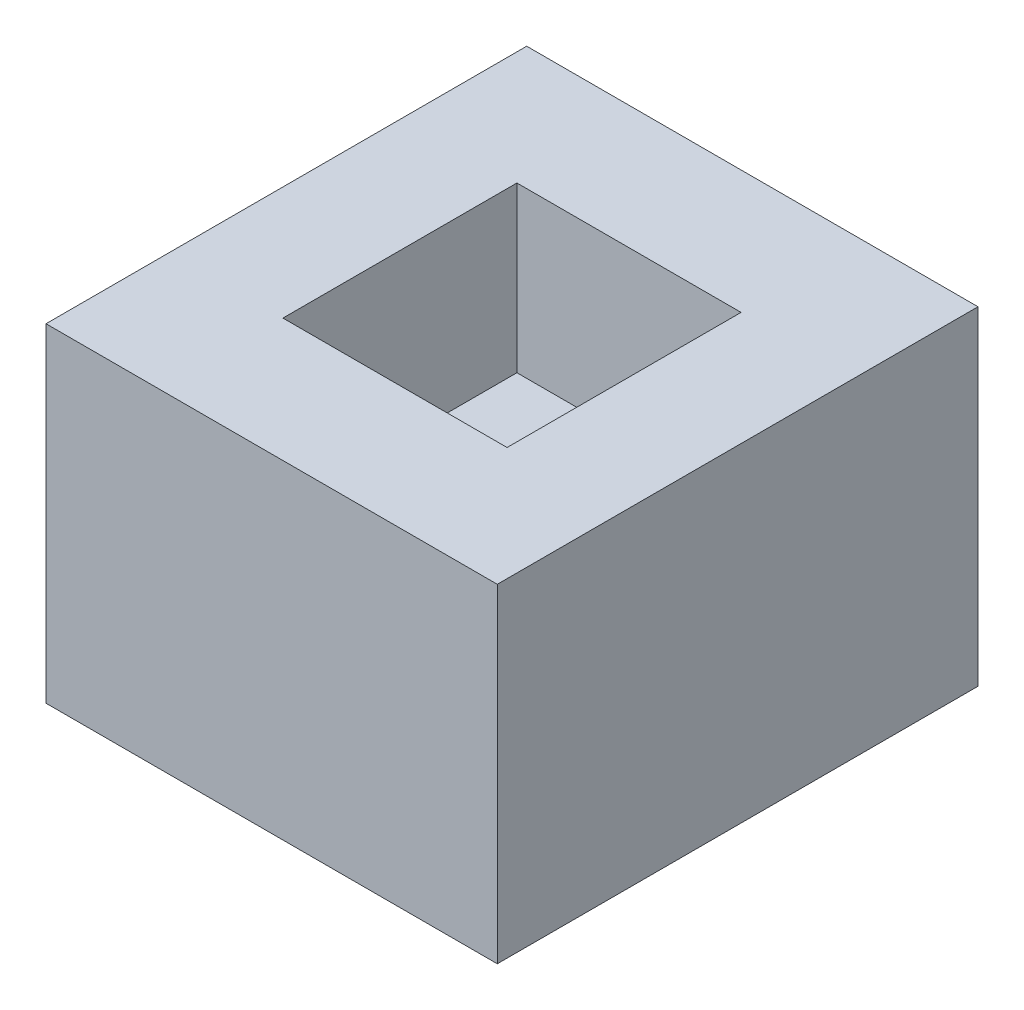
ISO-10303-21;
HEADER;
FILE_DESCRIPTION(('STEP AP214'),'2;1');
FILE_NAME('part.step','',(''),(''),'','','');
FILE_SCHEMA(('AUTOMOTIVE_DESIGN { 1 0 10303 214 1 1 1 1 }'));
ENDSEC;
DATA;
#1=APPLICATION_CONTEXT('core data for automotive mechanical design processes');
#2=APPLICATION_PROTOCOL_DEFINITION('international standard','automotive_design',2000,#1);
#3=PRODUCT_CONTEXT('',#1,'mechanical');
#4=PRODUCT('Part','Part','',(#3));
#5=PRODUCT_RELATED_PRODUCT_CATEGORY('part','',(#4));
#6=PRODUCT_DEFINITION_FORMATION('','',#4);
#7=PRODUCT_DEFINITION_CONTEXT('part definition',#1,'design');
#8=PRODUCT_DEFINITION('design','',#6,#7);
#9=PRODUCT_DEFINITION_SHAPE('','',#8);
#10=(LENGTH_UNIT() NAMED_UNIT(*) SI_UNIT(.MILLI.,.METRE.));
#11=(NAMED_UNIT(*) PLANE_ANGLE_UNIT() SI_UNIT($,.RADIAN.));
#12=(NAMED_UNIT(*) SI_UNIT($,.STERADIAN.) SOLID_ANGLE_UNIT());
#13=UNCERTAINTY_MEASURE_WITH_UNIT(LENGTH_MEASURE(1.E-05),#10,'distance_accuracy_value','');
#14=(GEOMETRIC_REPRESENTATION_CONTEXT(3) GLOBAL_UNCERTAINTY_ASSIGNED_CONTEXT((#13)) GLOBAL_UNIT_ASSIGNED_CONTEXT((#10,
#11,#12)) REPRESENTATION_CONTEXT('',''));
#15=CARTESIAN_POINT('',(0.,0.,0.));
#16=DIRECTION('',(0.,0.,1.));
#17=DIRECTION('',(1.,0.,0.));
#18=AXIS2_PLACEMENT_3D('',#15,#16,#17);
#19=CARTESIAN_POINT('',(-54.9226431235184,80.,58.5022382409761));
#20=DIRECTION('',(1.,0.,0.));
#21=DIRECTION('',(0.,0.,-1.));
#22=AXIS2_PLACEMENT_3D('',#19,#20,#21);
#23=PLANE('',#22);
#24=DIRECTION('',(0.,0.,1.));
#25=VECTOR('',#24,1.);
#26=CARTESIAN_POINT('',(-54.9226431235184,0.,58.5022382409761));
#27=LINE('',#26,#25);
#28=CARTESIAN_POINT('',(-54.9226431235184,0.,-58.5022382409761));
#29=VERTEX_POINT('',#28);
#30=CARTESIAN_POINT('',(-54.9226431235184,0.,58.5022382409761));
#31=VERTEX_POINT('',#30);
#32=EDGE_CURVE('E141',#29,#31,#27,.T.);
#33=ORIENTED_EDGE('',*,*,#32,.T.);
#34=DIRECTION('',(0.,-1.,0.));
#35=VECTOR('',#34,1.);
#36=CARTESIAN_POINT('',(-54.9226431235184,80.,58.5022382409761));
#37=LINE('',#36,#35);
#38=CARTESIAN_POINT('',(-54.9226431235184,80.,58.5022382409761));
#39=VERTEX_POINT('',#38);
#40=EDGE_CURVE('E11',#39,#31,#37,.T.);
#41=ORIENTED_EDGE('',*,*,#40,.F.);
#42=DIRECTION('',(0.,0.,1.));
#43=VECTOR('',#42,1.);
#44=CARTESIAN_POINT('',(-54.9226431235184,80.,58.5022382409761));
#45=LINE('',#44,#43);
#46=CARTESIAN_POINT('',(-54.9226431235184,80.,-58.5022382409761));
#47=VERTEX_POINT('',#46);
#48=EDGE_CURVE('E145',#47,#39,#45,.T.);
#49=ORIENTED_EDGE('',*,*,#48,.F.);
#50=DIRECTION('',(0.,-1.,0.));
#51=VECTOR('',#50,1.);
#52=CARTESIAN_POINT('',(-54.9226431235184,80.,-58.5022382409761));
#53=LINE('',#52,#51);
#54=EDGE_CURVE('E151',#47,#29,#53,.T.);
#55=ORIENTED_EDGE('',*,*,#54,.T.);
#56=EDGE_LOOP('',(#33,#41,#49,#55));
#57=FACE_BOUND('',#56,.T.);
#58=ADVANCED_FACE('F33',(#57),#23,.F.);
#59=CARTESIAN_POINT('',(54.9226431235184,80.,58.5022382409761));
#60=DIRECTION('',(0.,0.,-1.));
#61=DIRECTION('',(-1.,0.,0.));
#62=AXIS2_PLACEMENT_3D('',#59,#60,#61);
#63=PLANE('',#62);
#64=DIRECTION('',(1.,0.,0.));
#65=VECTOR('',#64,1.);
#66=CARTESIAN_POINT('',(54.9226431235184,0.,58.5022382409761));
#67=LINE('',#66,#65);
#68=CARTESIAN_POINT('',(54.9226431235184,0.,58.5022382409761));
#69=VERTEX_POINT('',#68);
#70=EDGE_CURVE('E154',#31,#69,#67,.T.);
#71=ORIENTED_EDGE('',*,*,#70,.T.);
#72=DIRECTION('',(0.,-1.,0.));
#73=VECTOR('',#72,1.);
#74=CARTESIAN_POINT('',(54.9226431235184,80.,58.5022382409761));
#75=LINE('',#74,#73);
#76=CARTESIAN_POINT('',(54.9226431235184,80.,58.5022382409761));
#77=VERTEX_POINT('',#76);
#78=EDGE_CURVE('E40',#77,#69,#75,.T.);
#79=ORIENTED_EDGE('',*,*,#78,.F.);
#80=DIRECTION('',(1.,0.,0.));
#81=VECTOR('',#80,1.);
#82=CARTESIAN_POINT('',(54.9226431235184,80.,58.5022382409761));
#83=LINE('',#82,#81);
#84=EDGE_CURVE('E84',#39,#77,#83,.T.);
#85=ORIENTED_EDGE('',*,*,#84,.F.);
#86=ORIENTED_EDGE('',*,*,#40,.T.);
#87=EDGE_LOOP('',(#71,#79,#85,#86));
#88=FACE_BOUND('',#87,.T.);
#89=ADVANCED_FACE('F183',(#88),#63,.F.);
#90=CARTESIAN_POINT('',(54.9226431235184,80.,58.5022382409761));
#91=DIRECTION('',(-1.,0.,0.));
#92=DIRECTION('',(0.,0.,1.));
#93=AXIS2_PLACEMENT_3D('',#90,#91,#92);
#94=PLANE('',#93);
#95=DIRECTION('',(0.,0.,-1.));
#96=VECTOR('',#95,1.);
#97=CARTESIAN_POINT('',(54.9226431235184,0.,58.5022382409761));
#98=LINE('',#97,#96);
#99=CARTESIAN_POINT('',(54.9226431235184,0.,-58.5022382409761));
#100=VERTEX_POINT('',#99);
#101=EDGE_CURVE('E156',#69,#100,#98,.T.);
#102=ORIENTED_EDGE('',*,*,#101,.T.);
#103=DIRECTION('',(0.,-1.,0.));
#104=VECTOR('',#103,1.);
#105=CARTESIAN_POINT('',(54.9226431235184,80.,-58.5022382409761));
#106=LINE('',#105,#104);
#107=CARTESIAN_POINT('',(54.9226431235184,80.,-58.5022382409761));
#108=VERTEX_POINT('',#107);
#109=EDGE_CURVE('E160',#108,#100,#106,.T.);
#110=ORIENTED_EDGE('',*,*,#109,.F.);
#111=DIRECTION('',(0.,0.,-1.));
#112=VECTOR('',#111,1.);
#113=CARTESIAN_POINT('',(54.9226431235184,80.,58.5022382409761));
#114=LINE('',#113,#112);
#115=EDGE_CURVE('E148',#77,#108,#114,.T.);
#116=ORIENTED_EDGE('',*,*,#115,.F.);
#117=ORIENTED_EDGE('',*,*,#78,.T.);
#118=EDGE_LOOP('',(#102,#110,#116,#117));
#119=FACE_BOUND('',#118,.T.);
#120=ADVANCED_FACE('F165',(#119),#94,.F.);
#121=CARTESIAN_POINT('',(54.9226431235184,80.,-58.5022382409761));
#122=DIRECTION('',(0.,0.,1.));
#123=DIRECTION('',(1.,0.,0.));
#124=AXIS2_PLACEMENT_3D('',#121,#122,#123);
#125=PLANE('',#124);
#126=DIRECTION('',(-1.,0.,0.));
#127=VECTOR('',#126,1.);
#128=CARTESIAN_POINT('',(54.9226431235184,0.,-58.5022382409761));
#129=LINE('',#128,#127);
#130=EDGE_CURVE('E77',#100,#29,#129,.T.);
#131=ORIENTED_EDGE('',*,*,#130,.T.);
#132=ORIENTED_EDGE('',*,*,#54,.F.);
#133=DIRECTION('',(-1.,0.,0.));
#134=VECTOR('',#133,1.);
#135=CARTESIAN_POINT('',(54.9226431235184,80.,-58.5022382409761));
#136=LINE('',#135,#134);
#137=EDGE_CURVE('E56',#108,#47,#136,.T.);
#138=ORIENTED_EDGE('',*,*,#137,.F.);
#139=ORIENTED_EDGE('',*,*,#109,.T.);
#140=EDGE_LOOP('',(#131,#132,#138,#139));
#141=FACE_BOUND('',#140,.T.);
#142=ADVANCED_FACE('F173',(#141),#125,.F.);
#143=CARTESIAN_POINT('',(0.,80.,0.));
#144=DIRECTION('',(0.,1.,0.));
#145=DIRECTION('',(0.,0.,1.));
#146=AXIS2_PLACEMENT_3D('',#143,#144,#145);
#147=PLANE('',#146);
#148=DIRECTION('',(0.,0.,1.));
#149=VECTOR('',#148,1.);
#150=CARTESIAN_POINT('',(-27.2806953910845,80.,28.4768639033928));
#151=LINE('',#150,#149);
#152=CARTESIAN_POINT('',(-27.2806953910845,80.,-28.4768639033928));
#153=VERTEX_POINT('',#152);
#154=CARTESIAN_POINT('',(-27.2806953910845,80.,28.4768639033928));
#155=VERTEX_POINT('',#154);
#156=EDGE_CURVE('E47',#153,#155,#151,.T.);
#157=ORIENTED_EDGE('',*,*,#156,.F.);
#158=DIRECTION('',(-1.,0.,0.));
#159=VECTOR('',#158,1.);
#160=CARTESIAN_POINT('',(27.2806953910845,80.,-28.4768639033928));
#161=LINE('',#160,#159);
#162=CARTESIAN_POINT('',(27.2806953910845,80.,-28.4768639033928));
#163=VERTEX_POINT('',#162);
#164=EDGE_CURVE('E126',#163,#153,#161,.T.);
#165=ORIENTED_EDGE('',*,*,#164,.F.);
#166=DIRECTION('',(0.,0.,-1.));
#167=VECTOR('',#166,1.);
#168=CARTESIAN_POINT('',(27.2806953910845,80.,28.4768639033928));
#169=LINE('',#168,#167);
#170=CARTESIAN_POINT('',(27.2806953910845,80.,28.4768639033928));
#171=VERTEX_POINT('',#170);
#172=EDGE_CURVE('E129',#171,#163,#169,.T.);
#173=ORIENTED_EDGE('',*,*,#172,.F.);
#174=DIRECTION('',(1.,0.,0.));
#175=VECTOR('',#174,1.);
#176=CARTESIAN_POINT('',(27.2806953910845,80.,28.4768639033928));
#177=LINE('',#176,#175);
#178=EDGE_CURVE('E135',#155,#171,#177,.T.);
#179=ORIENTED_EDGE('',*,*,#178,.F.);
#180=EDGE_LOOP('',(#157,#165,#173,#179));
#181=FACE_BOUND('',#180,.T.);
#182=ORIENTED_EDGE('',*,*,#48,.T.);
#183=ORIENTED_EDGE('',*,*,#84,.T.);
#184=ORIENTED_EDGE('',*,*,#115,.T.);
#185=ORIENTED_EDGE('',*,*,#137,.T.);
#186=EDGE_LOOP('',(#182,#183,#184,#185));
#187=FACE_BOUND('',#186,.T.);
#188=ADVANCED_FACE('F175',(#181,#187),#147,.T.);
#189=CARTESIAN_POINT('',(0.,0.,0.));
#190=DIRECTION('',(0.,1.,0.));
#191=DIRECTION('',(0.,0.,1.));
#192=AXIS2_PLACEMENT_3D('',#189,#190,#191);
#193=PLANE('',#192);
#194=ORIENTED_EDGE('',*,*,#32,.F.);
#195=ORIENTED_EDGE('',*,*,#130,.F.);
#196=ORIENTED_EDGE('',*,*,#101,.F.);
#197=ORIENTED_EDGE('',*,*,#70,.F.);
#198=EDGE_LOOP('',(#194,#195,#196,#197));
#199=FACE_BOUND('',#198,.T.);
#200=ADVANCED_FACE('F169',(#199),#193,.F.);
#201=CARTESIAN_POINT('',(-27.2806953910845,40.,28.4768639033928));
#202=DIRECTION('',(-1.,0.,0.));
#203=DIRECTION('',(0.,0.,1.));
#204=AXIS2_PLACEMENT_3D('',#201,#202,#203);
#205=PLANE('',#204);
#206=ORIENTED_EDGE('',*,*,#156,.T.);
#207=DIRECTION('',(0.,1.,0.));
#208=VECTOR('',#207,1.);
#209=CARTESIAN_POINT('',(-27.2806953910845,40.,28.4768639033928));
#210=LINE('',#209,#208);
#211=CARTESIAN_POINT('',(-27.2806953910845,40.,28.4768639033928));
#212=VERTEX_POINT('',#211);
#213=EDGE_CURVE('E104',#212,#155,#210,.T.);
#214=ORIENTED_EDGE('',*,*,#213,.F.);
#215=DIRECTION('',(0.,0.,1.));
#216=VECTOR('',#215,1.);
#217=CARTESIAN_POINT('',(-27.2806953910845,40.,28.4768639033928));
#218=LINE('',#217,#216);
#219=CARTESIAN_POINT('',(-27.2806953910845,40.,-28.4768639033928));
#220=VERTEX_POINT('',#219);
#221=EDGE_CURVE('E108',#220,#212,#218,.T.);
#222=ORIENTED_EDGE('',*,*,#221,.F.);
#223=DIRECTION('',(0.,1.,0.));
#224=VECTOR('',#223,1.);
#225=CARTESIAN_POINT('',(-27.2806953910845,40.,-28.4768639033928));
#226=LINE('',#225,#224);
#227=EDGE_CURVE('E139',#220,#153,#226,.T.);
#228=ORIENTED_EDGE('',*,*,#227,.T.);
#229=EDGE_LOOP('',(#206,#214,#222,#228));
#230=FACE_BOUND('',#229,.T.);
#231=ADVANCED_FACE('F106',(#230),#205,.F.);
#232=CARTESIAN_POINT('',(27.2806953910845,40.,-28.4768639033928));
#233=DIRECTION('',(0.,0.,-1.));
#234=DIRECTION('',(-1.,0.,0.));
#235=AXIS2_PLACEMENT_3D('',#232,#233,#234);
#236=PLANE('',#235);
#237=ORIENTED_EDGE('',*,*,#164,.T.);
#238=ORIENTED_EDGE('',*,*,#227,.F.);
#239=DIRECTION('',(-1.,0.,0.));
#240=VECTOR('',#239,1.);
#241=CARTESIAN_POINT('',(27.2806953910845,40.,-28.4768639033928));
#242=LINE('',#241,#240);
#243=CARTESIAN_POINT('',(27.2806953910845,40.,-28.4768639033928));
#244=VERTEX_POINT('',#243);
#245=EDGE_CURVE('E114',#244,#220,#242,.T.);
#246=ORIENTED_EDGE('',*,*,#245,.F.);
#247=DIRECTION('',(0.,1.,0.));
#248=VECTOR('',#247,1.);
#249=CARTESIAN_POINT('',(27.2806953910845,40.,-28.4768639033928));
#250=LINE('',#249,#248);
#251=EDGE_CURVE('E142',#244,#163,#250,.T.);
#252=ORIENTED_EDGE('',*,*,#251,.T.);
#253=EDGE_LOOP('',(#237,#238,#246,#252));
#254=FACE_BOUND('',#253,.T.);
#255=ADVANCED_FACE('F222',(#254),#236,.F.);
#256=CARTESIAN_POINT('',(27.2806953910845,40.,28.4768639033928));
#257=DIRECTION('',(1.,0.,0.));
#258=DIRECTION('',(0.,0.,-1.));
#259=AXIS2_PLACEMENT_3D('',#256,#257,#258);
#260=PLANE('',#259);
#261=ORIENTED_EDGE('',*,*,#172,.T.);
#262=ORIENTED_EDGE('',*,*,#251,.F.);
#263=DIRECTION('',(0.,0.,-1.));
#264=VECTOR('',#263,1.);
#265=CARTESIAN_POINT('',(27.2806953910845,40.,28.4768639033928));
#266=LINE('',#265,#264);
#267=CARTESIAN_POINT('',(27.2806953910845,40.,28.4768639033928));
#268=VERTEX_POINT('',#267);
#269=EDGE_CURVE('E122',#268,#244,#266,.T.);
#270=ORIENTED_EDGE('',*,*,#269,.F.);
#271=DIRECTION('',(0.,1.,0.));
#272=VECTOR('',#271,1.);
#273=CARTESIAN_POINT('',(27.2806953910845,40.,28.4768639033928));
#274=LINE('',#273,#272);
#275=EDGE_CURVE('E113',#268,#171,#274,.T.);
#276=ORIENTED_EDGE('',*,*,#275,.T.);
#277=EDGE_LOOP('',(#261,#262,#270,#276));
#278=FACE_BOUND('',#277,.T.);
#279=ADVANCED_FACE('F231',(#278),#260,.F.);
#280=CARTESIAN_POINT('',(27.2806953910845,40.,28.4768639033928));
#281=DIRECTION('',(0.,0.,1.));
#282=DIRECTION('',(1.,0.,0.));
#283=AXIS2_PLACEMENT_3D('',#280,#281,#282);
#284=PLANE('',#283);
#285=ORIENTED_EDGE('',*,*,#178,.T.);
#286=ORIENTED_EDGE('',*,*,#275,.F.);
#287=DIRECTION('',(1.,0.,0.));
#288=VECTOR('',#287,1.);
#289=CARTESIAN_POINT('',(27.2806953910845,40.,28.4768639033928));
#290=LINE('',#289,#288);
#291=EDGE_CURVE('E117',#212,#268,#290,.T.);
#292=ORIENTED_EDGE('',*,*,#291,.F.);
#293=ORIENTED_EDGE('',*,*,#213,.T.);
#294=EDGE_LOOP('',(#285,#286,#292,#293));
#295=FACE_BOUND('',#294,.T.);
#296=ADVANCED_FACE('F118',(#295),#284,.F.);
#297=CARTESIAN_POINT('',(0.,40.,0.));
#298=DIRECTION('',(0.,1.,0.));
#299=DIRECTION('',(0.,0.,1.));
#300=AXIS2_PLACEMENT_3D('',#297,#298,#299);
#301=PLANE('',#300);
#302=ORIENTED_EDGE('',*,*,#221,.T.);
#303=ORIENTED_EDGE('',*,*,#291,.T.);
#304=ORIENTED_EDGE('',*,*,#269,.T.);
#305=ORIENTED_EDGE('',*,*,#245,.T.);
#306=EDGE_LOOP('',(#302,#303,#304,#305));
#307=FACE_BOUND('',#306,.T.);
#308=ADVANCED_FACE('F124',(#307),#301,.T.);
#309=CLOSED_SHELL('',(#58,#89,#120,#142,#188,#200,#231,#255,#279,#296,#308));
#310=MANIFOLD_SOLID_BREP('B2',#309);
#311=ADVANCED_BREP_SHAPE_REPRESENTATION('',(#18,#310),#14);
#312=SHAPE_DEFINITION_REPRESENTATION(#9,#311);
ENDSEC;
END-ISO-10303-21;
